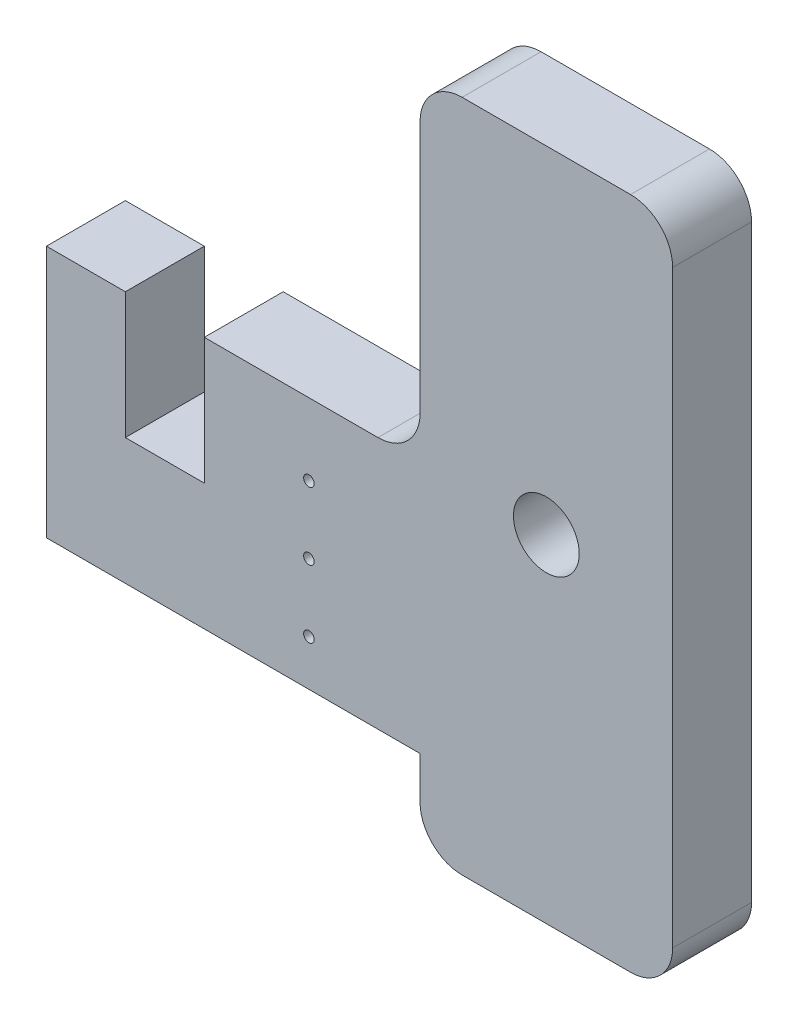
ISO-10303-21;
HEADER;
FILE_DESCRIPTION(('STEP AP214'),'2;1');
FILE_NAME('part.step','',(''),(''),'','','');
FILE_SCHEMA(('AUTOMOTIVE_DESIGN { 1 0 10303 214 1 1 1 1 }'));
ENDSEC;
DATA;
#1=APPLICATION_CONTEXT('core data for automotive mechanical design processes');
#2=APPLICATION_PROTOCOL_DEFINITION('international standard','automotive_design',2000,#1);
#3=PRODUCT_CONTEXT('',#1,'mechanical');
#4=PRODUCT('Part','Part','',(#3));
#5=PRODUCT_RELATED_PRODUCT_CATEGORY('part','',(#4));
#6=PRODUCT_DEFINITION_FORMATION('','',#4);
#7=PRODUCT_DEFINITION_CONTEXT('part definition',#1,'design');
#8=PRODUCT_DEFINITION('design','',#6,#7);
#9=PRODUCT_DEFINITION_SHAPE('','',#8);
#10=(LENGTH_UNIT() NAMED_UNIT(*) SI_UNIT(.MILLI.,.METRE.));
#11=(NAMED_UNIT(*) PLANE_ANGLE_UNIT() SI_UNIT($,.RADIAN.));
#12=(NAMED_UNIT(*) SI_UNIT($,.STERADIAN.) SOLID_ANGLE_UNIT());
#13=UNCERTAINTY_MEASURE_WITH_UNIT(LENGTH_MEASURE(1.E-05),#10,'distance_accuracy_value','');
#14=(GEOMETRIC_REPRESENTATION_CONTEXT(3) GLOBAL_UNCERTAINTY_ASSIGNED_CONTEXT((#13)) GLOBAL_UNIT_ASSIGNED_CONTEXT((#10,
#11,#12)) REPRESENTATION_CONTEXT('',''));
#15=CARTESIAN_POINT('',(0.,0.,0.));
#16=DIRECTION('',(0.,0.,1.));
#17=DIRECTION('',(1.,0.,0.));
#18=AXIS2_PLACEMENT_3D('',#15,#16,#17);
#19=CARTESIAN_POINT('',(0.,0.,9.525));
#20=DIRECTION('',(0.,1.,0.));
#21=DIRECTION('',(-1.,0.,0.));
#22=AXIS2_PLACEMENT_3D('',#19,#20,#21);
#23=PLANE('',#22);
#24=DIRECTION('',(1.,0.,0.));
#25=VECTOR('',#24,1.);
#26=CARTESIAN_POINT('',(0.,0.,9.525));
#27=LINE('',#26,#25);
#28=CARTESIAN_POINT('',(-41.275,0.,9.525));
#29=VERTEX_POINT('',#28);
#30=CARTESIAN_POINT('',(-20.32,0.,9.525));
#31=VERTEX_POINT('',#30);
#32=EDGE_CURVE('E164',#29,#31,#27,.T.);
#33=ORIENTED_EDGE('',*,*,#32,.T.);
#34=DIRECTION('',(0.,0.,-1.));
#35=VECTOR('',#34,1.);
#36=CARTESIAN_POINT('',(-20.32,0.,9.525));
#37=LINE('',#36,#35);
#38=CARTESIAN_POINT('',(-20.32,0.,0.));
#39=VERTEX_POINT('',#38);
#40=EDGE_CURVE('E172',#31,#39,#37,.T.);
#41=ORIENTED_EDGE('',*,*,#40,.T.);
#42=DIRECTION('',(1.,0.,0.));
#43=VECTOR('',#42,1.);
#44=CARTESIAN_POINT('',(0.,0.,0.));
#45=LINE('',#44,#43);
#46=CARTESIAN_POINT('',(-41.275,0.,0.));
#47=VERTEX_POINT('',#46);
#48=EDGE_CURVE('E167',#47,#39,#45,.T.);
#49=ORIENTED_EDGE('',*,*,#48,.F.);
#50=DIRECTION('',(0.,0.,-1.));
#51=VECTOR('',#50,1.);
#52=CARTESIAN_POINT('',(-41.275,0.,9.525));
#53=LINE('',#52,#51);
#54=EDGE_CURVE('E161',#29,#47,#53,.T.);
#55=ORIENTED_EDGE('',*,*,#54,.F.);
#56=EDGE_LOOP('',(#33,#41,#49,#55));
#57=FACE_BOUND('',#56,.T.);
#58=ADVANCED_FACE('F41',(#57),#23,.T.);
#59=CARTESIAN_POINT('',(-41.275,0.,9.525));
#60=DIRECTION('',(-1.,0.,0.));
#61=DIRECTION('',(0.,0.,1.));
#62=AXIS2_PLACEMENT_3D('',#59,#60,#61);
#63=PLANE('',#62);
#64=DIRECTION('',(0.,1.,0.));
#65=VECTOR('',#64,1.);
#66=CARTESIAN_POINT('',(-41.275,0.,0.));
#67=LINE('',#66,#65);
#68=CARTESIAN_POINT('',(-41.275,-15.24,0.));
#69=VERTEX_POINT('',#68);
#70=EDGE_CURVE('E219',#69,#47,#67,.T.);
#71=ORIENTED_EDGE('',*,*,#70,.F.);
#72=DIRECTION('',(0.,0.,-1.));
#73=VECTOR('',#72,1.);
#74=CARTESIAN_POINT('',(-41.275,-15.24,9.525));
#75=LINE('',#74,#73);
#76=CARTESIAN_POINT('',(-41.275,-15.24,9.525));
#77=VERTEX_POINT('',#76);
#78=EDGE_CURVE('E173',#77,#69,#75,.T.);
#79=ORIENTED_EDGE('',*,*,#78,.F.);
#80=DIRECTION('',(0.,1.,0.));
#81=VECTOR('',#80,1.);
#82=CARTESIAN_POINT('',(-41.275,0.,9.525));
#83=LINE('',#82,#81);
#84=EDGE_CURVE('E179',#77,#29,#83,.T.);
#85=ORIENTED_EDGE('',*,*,#84,.T.);
#86=ORIENTED_EDGE('',*,*,#54,.T.);
#87=EDGE_LOOP('',(#71,#79,#85,#86));
#88=FACE_BOUND('',#87,.T.);
#89=ADVANCED_FACE('F185',(#88),#63,.T.);
#90=CARTESIAN_POINT('',(0.,-15.24,9.525));
#91=DIRECTION('',(0.,1.,0.));
#92=DIRECTION('',(-1.,0.,0.));
#93=AXIS2_PLACEMENT_3D('',#90,#91,#92);
#94=PLANE('',#93);
#95=DIRECTION('',(1.,0.,0.));
#96=VECTOR('',#95,1.);
#97=CARTESIAN_POINT('',(0.,-15.24,0.));
#98=LINE('',#97,#96);
#99=CARTESIAN_POINT('',(-50.8,-15.24,0.));
#100=VERTEX_POINT('',#99);
#101=EDGE_CURVE('E221',#100,#69,#98,.T.);
#102=ORIENTED_EDGE('',*,*,#101,.F.);
#103=DIRECTION('',(0.,0.,-1.));
#104=VECTOR('',#103,1.);
#105=CARTESIAN_POINT('',(-50.8,-15.24,9.525));
#106=LINE('',#105,#104);
#107=CARTESIAN_POINT('',(-50.8,-15.24,9.525));
#108=VERTEX_POINT('',#107);
#109=EDGE_CURVE('E259',#108,#100,#106,.T.);
#110=ORIENTED_EDGE('',*,*,#109,.F.);
#111=DIRECTION('',(1.,0.,0.));
#112=VECTOR('',#111,1.);
#113=CARTESIAN_POINT('',(0.,-15.24,9.525));
#114=LINE('',#113,#112);
#115=EDGE_CURVE('E186',#108,#77,#114,.T.);
#116=ORIENTED_EDGE('',*,*,#115,.T.);
#117=ORIENTED_EDGE('',*,*,#78,.T.);
#118=EDGE_LOOP('',(#102,#110,#116,#117));
#119=FACE_BOUND('',#118,.T.);
#120=ADVANCED_FACE('F328',(#119),#94,.T.);
#121=CARTESIAN_POINT('',(-50.8,0.,9.525));
#122=DIRECTION('',(-1.,0.,0.));
#123=DIRECTION('',(0.,0.,1.));
#124=AXIS2_PLACEMENT_3D('',#121,#122,#123);
#125=PLANE('',#124);
#126=DIRECTION('',(0.,1.,0.));
#127=VECTOR('',#126,1.);
#128=CARTESIAN_POINT('',(-50.8,0.,0.));
#129=LINE('',#128,#127);
#130=CARTESIAN_POINT('',(-50.8,0.,0.));
#131=VERTEX_POINT('',#130);
#132=EDGE_CURVE('E224',#100,#131,#129,.T.);
#133=ORIENTED_EDGE('',*,*,#132,.T.);
#134=DIRECTION('',(0.,0.,-1.));
#135=VECTOR('',#134,1.);
#136=CARTESIAN_POINT('',(-50.8,0.,9.525));
#137=LINE('',#136,#135);
#138=CARTESIAN_POINT('',(-50.8,0.,9.525));
#139=VERTEX_POINT('',#138);
#140=EDGE_CURVE('E257',#139,#131,#137,.T.);
#141=ORIENTED_EDGE('',*,*,#140,.F.);
#142=DIRECTION('',(0.,1.,0.));
#143=VECTOR('',#142,1.);
#144=CARTESIAN_POINT('',(-50.8,0.,9.525));
#145=LINE('',#144,#143);
#146=EDGE_CURVE('E188',#108,#139,#145,.T.);
#147=ORIENTED_EDGE('',*,*,#146,.F.);
#148=ORIENTED_EDGE('',*,*,#109,.T.);
#149=EDGE_LOOP('',(#133,#141,#147,#148));
#150=FACE_BOUND('',#149,.T.);
#151=ADVANCED_FACE('F416',(#150),#125,.F.);
#152=CARTESIAN_POINT('',(0.,0.,9.525));
#153=DIRECTION('',(0.,1.,0.));
#154=DIRECTION('',(-1.,0.,0.));
#155=AXIS2_PLACEMENT_3D('',#152,#153,#154);
#156=PLANE('',#155);
#157=DIRECTION('',(1.,0.,0.));
#158=VECTOR('',#157,1.);
#159=CARTESIAN_POINT('',(0.,0.,0.));
#160=LINE('',#159,#158);
#161=CARTESIAN_POINT('',(-60.325,0.,0.));
#162=VERTEX_POINT('',#161);
#163=EDGE_CURVE('E227',#162,#131,#160,.T.);
#164=ORIENTED_EDGE('',*,*,#163,.F.);
#165=DIRECTION('',(0.,0.,-1.));
#166=VECTOR('',#165,1.);
#167=CARTESIAN_POINT('',(-60.325,0.,9.525));
#168=LINE('',#167,#166);
#169=CARTESIAN_POINT('',(-60.325,0.,9.525));
#170=VERTEX_POINT('',#169);
#171=EDGE_CURVE('E255',#170,#162,#168,.T.);
#172=ORIENTED_EDGE('',*,*,#171,.F.);
#173=DIRECTION('',(1.,0.,0.));
#174=VECTOR('',#173,1.);
#175=CARTESIAN_POINT('',(0.,0.,9.525));
#176=LINE('',#175,#174);
#177=EDGE_CURVE('E193',#170,#139,#176,.T.);
#178=ORIENTED_EDGE('',*,*,#177,.T.);
#179=ORIENTED_EDGE('',*,*,#140,.T.);
#180=EDGE_LOOP('',(#164,#172,#178,#179));
#181=FACE_BOUND('',#180,.T.);
#182=ADVANCED_FACE('F412',(#181),#156,.T.);
#183=CARTESIAN_POINT('',(-60.325,0.,9.525));
#184=DIRECTION('',(1.,0.,0.));
#185=DIRECTION('',(0.,1.,0.));
#186=AXIS2_PLACEMENT_3D('',#183,#184,#185);
#187=PLANE('',#186);
#188=DIRECTION('',(0.,-1.,0.));
#189=VECTOR('',#188,1.);
#190=CARTESIAN_POINT('',(-60.325,0.,0.));
#191=LINE('',#190,#189);
#192=CARTESIAN_POINT('',(-60.325,-30.48,0.));
#193=VERTEX_POINT('',#192);
#194=EDGE_CURVE('E230',#162,#193,#191,.T.);
#195=ORIENTED_EDGE('',*,*,#194,.T.);
#196=DIRECTION('',(0.,0.,-1.));
#197=VECTOR('',#196,1.);
#198=CARTESIAN_POINT('',(-60.325,-30.48,9.525));
#199=LINE('',#198,#197);
#200=CARTESIAN_POINT('',(-60.325,-30.48,9.525));
#201=VERTEX_POINT('',#200);
#202=EDGE_CURVE('E252',#201,#193,#199,.T.);
#203=ORIENTED_EDGE('',*,*,#202,.F.);
#204=DIRECTION('',(0.,-1.,0.));
#205=VECTOR('',#204,1.);
#206=CARTESIAN_POINT('',(-60.325,0.,9.525));
#207=LINE('',#206,#205);
#208=EDGE_CURVE('E196',#170,#201,#207,.T.);
#209=ORIENTED_EDGE('',*,*,#208,.F.);
#210=ORIENTED_EDGE('',*,*,#171,.T.);
#211=EDGE_LOOP('',(#195,#203,#209,#210));
#212=FACE_BOUND('',#211,.T.);
#213=ADVANCED_FACE('F408',(#212),#187,.F.);
#214=CARTESIAN_POINT('',(0.,-30.48,9.525));
#215=DIRECTION('',(0.,1.,0.));
#216=DIRECTION('',(-1.,0.,0.));
#217=AXIS2_PLACEMENT_3D('',#214,#215,#216);
#218=PLANE('',#217);
#219=DIRECTION('',(1.,0.,0.));
#220=VECTOR('',#219,1.);
#221=CARTESIAN_POINT('',(0.,-30.48,0.));
#222=LINE('',#221,#220);
#223=CARTESIAN_POINT('',(-15.24,-30.48,0.));
#224=VERTEX_POINT('',#223);
#225=EDGE_CURVE('E233',#193,#224,#222,.T.);
#226=ORIENTED_EDGE('',*,*,#225,.T.);
#227=DIRECTION('',(0.,0.,-1.));
#228=VECTOR('',#227,1.);
#229=CARTESIAN_POINT('',(-15.24,-30.48,9.525));
#230=LINE('',#229,#228);
#231=CARTESIAN_POINT('',(-15.24,-30.48,9.525));
#232=VERTEX_POINT('',#231);
#233=EDGE_CURVE('E213',#232,#224,#230,.T.);
#234=ORIENTED_EDGE('',*,*,#233,.F.);
#235=DIRECTION('',(1.,0.,0.));
#236=VECTOR('',#235,1.);
#237=CARTESIAN_POINT('',(0.,-30.48,9.525));
#238=LINE('',#237,#236);
#239=EDGE_CURVE('E199',#201,#232,#238,.T.);
#240=ORIENTED_EDGE('',*,*,#239,.F.);
#241=ORIENTED_EDGE('',*,*,#202,.T.);
#242=EDGE_LOOP('',(#226,#234,#240,#241));
#243=FACE_BOUND('',#242,.T.);
#244=ADVANCED_FACE('F404',(#243),#218,.F.);
#245=CARTESIAN_POINT('',(-15.24,0.,9.525));
#246=DIRECTION('',(-1.,0.,0.));
#247=DIRECTION('',(0.,0.,1.));
#248=AXIS2_PLACEMENT_3D('',#245,#246,#247);
#249=PLANE('',#248);
#250=DIRECTION('',(0.,1.,0.));
#251=VECTOR('',#250,1.);
#252=CARTESIAN_POINT('',(-15.24,0.,0.));
#253=LINE('',#252,#251);
#254=CARTESIAN_POINT('',(-15.24,-35.56,0.));
#255=VERTEX_POINT('',#254);
#256=EDGE_CURVE('E236',#255,#224,#253,.T.);
#257=ORIENTED_EDGE('',*,*,#256,.F.);
#258=DIRECTION('',(0.,0.,-1.));
#259=VECTOR('',#258,1.);
#260=CARTESIAN_POINT('',(-15.24,-35.56,9.525));
#261=LINE('',#260,#259);
#262=CARTESIAN_POINT('',(-15.24,-35.56,9.525));
#263=VERTEX_POINT('',#262);
#264=EDGE_CURVE('E281',#255,#263,#261,.F.);
#265=ORIENTED_EDGE('',*,*,#264,.T.);
#266=DIRECTION('',(0.,1.,0.));
#267=VECTOR('',#266,1.);
#268=CARTESIAN_POINT('',(-15.24,0.,9.525));
#269=LINE('',#268,#267);
#270=EDGE_CURVE('E202',#263,#232,#269,.T.);
#271=ORIENTED_EDGE('',*,*,#270,.T.);
#272=ORIENTED_EDGE('',*,*,#233,.T.);
#273=EDGE_LOOP('',(#257,#265,#271,#272));
#274=FACE_BOUND('',#273,.T.);
#275=ADVANCED_FACE('F400',(#274),#249,.T.);
#276=CARTESIAN_POINT('',(0.,-40.64,9.525));
#277=DIRECTION('',(0.,1.,0.));
#278=DIRECTION('',(0.,0.,1.));
#279=AXIS2_PLACEMENT_3D('',#276,#277,#278);
#280=PLANE('',#279);
#281=DIRECTION('',(1.,0.,0.));
#282=VECTOR('',#281,1.);
#283=CARTESIAN_POINT('',(0.,-40.64,9.525));
#284=LINE('',#283,#282);
#285=CARTESIAN_POINT('',(-10.16,-40.64,9.525));
#286=VERTEX_POINT('',#285);
#287=CARTESIAN_POINT('',(10.16,-40.64,9.525));
#288=VERTEX_POINT('',#287);
#289=EDGE_CURVE('E204',#286,#288,#284,.T.);
#290=ORIENTED_EDGE('',*,*,#289,.F.);
#291=DIRECTION('',(0.,0.,-1.));
#292=VECTOR('',#291,1.);
#293=CARTESIAN_POINT('',(-10.16,-40.64,0.));
#294=LINE('',#293,#292);
#295=CARTESIAN_POINT('',(-10.16,-40.64,0.));
#296=VERTEX_POINT('',#295);
#297=EDGE_CURVE('E270',#286,#296,#294,.T.);
#298=ORIENTED_EDGE('',*,*,#297,.T.);
#299=DIRECTION('',(1.,0.,0.));
#300=VECTOR('',#299,1.);
#301=CARTESIAN_POINT('',(0.,-40.64,0.));
#302=LINE('',#301,#300);
#303=CARTESIAN_POINT('',(10.16,-40.64,0.));
#304=VERTEX_POINT('',#303);
#305=EDGE_CURVE('E238',#296,#304,#302,.T.);
#306=ORIENTED_EDGE('',*,*,#305,.T.);
#307=DIRECTION('',(0.,0.,-1.));
#308=VECTOR('',#307,1.);
#309=CARTESIAN_POINT('',(10.16,-40.64,9.525));
#310=LINE('',#309,#308);
#311=EDGE_CURVE('E268',#304,#288,#310,.F.);
#312=ORIENTED_EDGE('',*,*,#311,.T.);
#313=EDGE_LOOP('',(#290,#298,#306,#312));
#314=FACE_BOUND('',#313,.T.);
#315=ADVANCED_FACE('F396',(#314),#280,.F.);
#316=CARTESIAN_POINT('',(15.24,0.,9.525));
#317=DIRECTION('',(-1.,0.,0.));
#318=DIRECTION('',(0.,0.,1.));
#319=AXIS2_PLACEMENT_3D('',#316,#317,#318);
#320=PLANE('',#319);
#321=DIRECTION('',(0.,1.,0.));
#322=VECTOR('',#321,1.);
#323=CARTESIAN_POINT('',(15.24,0.,0.));
#324=LINE('',#323,#322);
#325=CARTESIAN_POINT('',(15.24,-35.56,0.));
#326=VERTEX_POINT('',#325);
#327=CARTESIAN_POINT('',(15.24,35.56,0.));
#328=VERTEX_POINT('',#327);
#329=EDGE_CURVE('E241',#326,#328,#324,.T.);
#330=ORIENTED_EDGE('',*,*,#329,.T.);
#331=DIRECTION('',(0.,0.,-1.));
#332=VECTOR('',#331,1.);
#333=CARTESIAN_POINT('',(15.24,35.56,9.525));
#334=LINE('',#333,#332);
#335=CARTESIAN_POINT('',(15.24,35.56,9.525));
#336=VERTEX_POINT('',#335);
#337=EDGE_CURVE('E297',#328,#336,#334,.F.);
#338=ORIENTED_EDGE('',*,*,#337,.T.);
#339=DIRECTION('',(0.,1.,0.));
#340=VECTOR('',#339,1.);
#341=CARTESIAN_POINT('',(15.24,0.,9.525));
#342=LINE('',#341,#340);
#343=CARTESIAN_POINT('',(15.24,-35.56,9.525));
#344=VERTEX_POINT('',#343);
#345=EDGE_CURVE('E207',#344,#336,#342,.T.);
#346=ORIENTED_EDGE('',*,*,#345,.F.);
#347=DIRECTION('',(0.,0.,-1.));
#348=VECTOR('',#347,1.);
#349=CARTESIAN_POINT('',(15.24,-35.56,9.525));
#350=LINE('',#349,#348);
#351=EDGE_CURVE('E294',#344,#326,#350,.T.);
#352=ORIENTED_EDGE('',*,*,#351,.T.);
#353=EDGE_LOOP('',(#330,#338,#346,#352));
#354=FACE_BOUND('',#353,.T.);
#355=ADVANCED_FACE('F340',(#354),#320,.F.);
#356=CARTESIAN_POINT('',(0.,40.64,9.525));
#357=DIRECTION('',(0.,1.,0.));
#358=DIRECTION('',(0.,0.,1.));
#359=AXIS2_PLACEMENT_3D('',#356,#357,#358);
#360=PLANE('',#359);
#361=DIRECTION('',(1.,0.,0.));
#362=VECTOR('',#361,1.);
#363=CARTESIAN_POINT('',(0.,40.64,0.));
#364=LINE('',#363,#362);
#365=CARTESIAN_POINT('',(-10.16,40.64,0.));
#366=VERTEX_POINT('',#365);
#367=CARTESIAN_POINT('',(10.16,40.64,0.));
#368=VERTEX_POINT('',#367);
#369=EDGE_CURVE('E244',#366,#368,#364,.T.);
#370=ORIENTED_EDGE('',*,*,#369,.F.);
#371=DIRECTION('',(0.,0.,-1.));
#372=VECTOR('',#371,1.);
#373=CARTESIAN_POINT('',(-10.16,40.64,9.525));
#374=LINE('',#373,#372);
#375=CARTESIAN_POINT('',(-10.16,40.64,9.525));
#376=VERTEX_POINT('',#375);
#377=EDGE_CURVE('E63',#366,#376,#374,.F.);
#378=ORIENTED_EDGE('',*,*,#377,.T.);
#379=DIRECTION('',(1.,0.,0.));
#380=VECTOR('',#379,1.);
#381=CARTESIAN_POINT('',(0.,40.64,9.525));
#382=LINE('',#381,#380);
#383=CARTESIAN_POINT('',(10.16,40.64,9.525));
#384=VERTEX_POINT('',#383);
#385=EDGE_CURVE('E209',#376,#384,#382,.T.);
#386=ORIENTED_EDGE('',*,*,#385,.T.);
#387=DIRECTION('',(0.,0.,-1.));
#388=VECTOR('',#387,1.);
#389=CARTESIAN_POINT('',(10.16,40.64,0.));
#390=LINE('',#389,#388);
#391=EDGE_CURVE('E290',#384,#368,#390,.T.);
#392=ORIENTED_EDGE('',*,*,#391,.T.);
#393=EDGE_LOOP('',(#370,#378,#386,#392));
#394=FACE_BOUND('',#393,.T.);
#395=ADVANCED_FACE('F333',(#394),#360,.T.);
#396=CARTESIAN_POINT('',(0.,0.,9.525));
#397=DIRECTION('',(0.,0.,-1.));
#398=DIRECTION('',(-1.,0.,0.));
#399=AXIS2_PLACEMENT_3D('',#396,#397,#398);
#400=CYLINDRICAL_SURFACE('',#399,3.96875);
#401=CARTESIAN_POINT('',(0.,0.,9.525));
#402=DIRECTION('',(0.,0.,1.));
#403=DIRECTION('',(1.,0.,0.));
#404=AXIS2_PLACEMENT_3D('',#401,#402,#403);
#405=CIRCLE('',#404,3.96875);
#406=CARTESIAN_POINT('',(3.96875,0.,9.525));
#407=VERTEX_POINT('',#406);
#408=EDGE_CURVE('E183',#407,#407,#405,.T.);
#409=ORIENTED_EDGE('',*,*,#408,.T.);
#410=EDGE_LOOP('',(#409));
#411=FACE_BOUND('',#410,.T.);
#412=CARTESIAN_POINT('',(0.,0.,0.));
#413=DIRECTION('',(0.,0.,1.));
#414=DIRECTION('',(1.,0.,0.));
#415=AXIS2_PLACEMENT_3D('',#412,#413,#414);
#416=CIRCLE('',#415,3.96875);
#417=CARTESIAN_POINT('',(3.96875,0.,0.));
#418=VERTEX_POINT('',#417);
#419=EDGE_CURVE('E214',#418,#418,#416,.T.);
#420=ORIENTED_EDGE('',*,*,#419,.F.);
#421=EDGE_LOOP('',(#420));
#422=FACE_BOUND('',#421,.T.);
#423=ADVANCED_FACE('F331',(#411,#422),#400,.F.);
#424=CARTESIAN_POINT('',(-15.24,0.,9.525));
#425=DIRECTION('',(1.,0.,0.));
#426=DIRECTION('',(0.,1.,0.));
#427=AXIS2_PLACEMENT_3D('',#424,#425,#426);
#428=PLANE('',#427);
#429=DIRECTION('',(0.,-1.,0.));
#430=VECTOR('',#429,1.);
#431=CARTESIAN_POINT('',(-15.24,0.,0.));
#432=LINE('',#431,#430);
#433=CARTESIAN_POINT('',(-15.24,35.56,0.));
#434=VERTEX_POINT('',#433);
#435=CARTESIAN_POINT('',(-15.24,5.08000000000002,0.));
#436=VERTEX_POINT('',#435);
#437=EDGE_CURVE('E247',#434,#436,#432,.T.);
#438=ORIENTED_EDGE('',*,*,#437,.T.);
#439=DIRECTION('',(0.,0.,-1.));
#440=VECTOR('',#439,1.);
#441=CARTESIAN_POINT('',(-15.24,5.08000000000002,9.525));
#442=LINE('',#441,#440);
#443=CARTESIAN_POINT('',(-15.24,5.08000000000002,9.525));
#444=VERTEX_POINT('',#443);
#445=EDGE_CURVE('E266',#436,#444,#442,.F.);
#446=ORIENTED_EDGE('',*,*,#445,.T.);
#447=DIRECTION('',(0.,-1.,0.));
#448=VECTOR('',#447,1.);
#449=CARTESIAN_POINT('',(-15.24,0.,9.525));
#450=LINE('',#449,#448);
#451=CARTESIAN_POINT('',(-15.24,35.56,9.525));
#452=VERTEX_POINT('',#451);
#453=EDGE_CURVE('E211',#452,#444,#450,.T.);
#454=ORIENTED_EDGE('',*,*,#453,.F.);
#455=DIRECTION('',(0.,0.,-1.));
#456=VECTOR('',#455,1.);
#457=CARTESIAN_POINT('',(-15.24,35.56,0.));
#458=LINE('',#457,#456);
#459=EDGE_CURVE('E263',#452,#434,#458,.T.);
#460=ORIENTED_EDGE('',*,*,#459,.T.);
#461=EDGE_LOOP('',(#438,#446,#454,#460));
#462=FACE_BOUND('',#461,.T.);
#463=ADVANCED_FACE('F305',(#462),#428,.F.);
#464=CARTESIAN_POINT('',(0.,0.,9.525));
#465=DIRECTION('',(0.,0.,1.));
#466=DIRECTION('',(1.,0.,0.));
#467=AXIS2_PLACEMENT_3D('',#464,#465,#466);
#468=PLANE('',#467);
#469=CARTESIAN_POINT('',(-28.6512000000001,-8.68299999999999,9.525));
#470=DIRECTION('',(0.,0.,1.));
#471=DIRECTION('',(1.,0.,0.));
#472=AXIS2_PLACEMENT_3D('',#469,#470,#471);
#473=CIRCLE('',#472,0.634999999999999);
#474=CARTESIAN_POINT('',(-28.0162000000001,-8.68299999999999,9.525));
#475=VERTEX_POINT('',#474);
#476=EDGE_CURVE('E359',#475,#475,#473,.T.);
#477=ORIENTED_EDGE('',*,*,#476,.F.);
#478=EDGE_LOOP('',(#477));
#479=FACE_BOUND('',#478,.T.);
#480=CARTESIAN_POINT('',(-28.6512000000001,-16.8255456111321,9.525));
#481=DIRECTION('',(0.,0.,1.));
#482=DIRECTION('',(1.,0.,0.));
#483=AXIS2_PLACEMENT_3D('',#480,#481,#482);
#484=CIRCLE('',#483,0.634999999999999);
#485=CARTESIAN_POINT('',(-28.0162000000001,-16.8255456111321,9.525));
#486=VERTEX_POINT('',#485);
#487=EDGE_CURVE('E352',#486,#486,#484,.T.);
#488=ORIENTED_EDGE('',*,*,#487,.F.);
#489=EDGE_LOOP('',(#488));
#490=FACE_BOUND('',#489,.T.);
#491=CARTESIAN_POINT('',(-28.6512000000001,-24.9680912222642,9.525));
#492=DIRECTION('',(0.,0.,1.));
#493=DIRECTION('',(1.,0.,0.));
#494=AXIS2_PLACEMENT_3D('',#491,#492,#493);
#495=CIRCLE('',#494,0.634999999999999);
#496=CARTESIAN_POINT('',(-28.0162000000001,-24.9680912222642,9.525));
#497=VERTEX_POINT('',#496);
#498=EDGE_CURVE('E353',#497,#497,#495,.T.);
#499=ORIENTED_EDGE('',*,*,#498,.F.);
#500=EDGE_LOOP('',(#499));
#501=FACE_BOUND('',#500,.T.);
#502=ORIENTED_EDGE('',*,*,#408,.F.);
#503=EDGE_LOOP('',(#502));
#504=FACE_BOUND('',#503,.T.);
#505=ORIENTED_EDGE('',*,*,#270,.F.);
#506=CARTESIAN_POINT('',(-10.16,-35.56,9.525));
#507=DIRECTION('',(0.,0.,1.));
#508=DIRECTION('',(1.,0.,0.));
#509=AXIS2_PLACEMENT_3D('',#506,#507,#508);
#510=CIRCLE('',#509,5.08);
#511=EDGE_CURVE('E288',#263,#286,#510,.T.);
#512=ORIENTED_EDGE('',*,*,#511,.T.);
#513=ORIENTED_EDGE('',*,*,#289,.T.);
#514=CARTESIAN_POINT('',(10.16,-35.56,9.525));
#515=DIRECTION('',(0.,0.,1.));
#516=DIRECTION('',(1.,0.,0.));
#517=AXIS2_PLACEMENT_3D('',#514,#515,#516);
#518=CIRCLE('',#517,5.08);
#519=EDGE_CURVE('E283',#288,#344,#518,.T.);
#520=ORIENTED_EDGE('',*,*,#519,.T.);
#521=ORIENTED_EDGE('',*,*,#345,.T.);
#522=CARTESIAN_POINT('',(10.16,35.56,9.525));
#523=DIRECTION('',(0.,0.,1.));
#524=DIRECTION('',(1.,0.,0.));
#525=AXIS2_PLACEMENT_3D('',#522,#523,#524);
#526=CIRCLE('',#525,5.08);
#527=EDGE_CURVE('E56',#336,#384,#526,.T.);
#528=ORIENTED_EDGE('',*,*,#527,.T.);
#529=ORIENTED_EDGE('',*,*,#385,.F.);
#530=CARTESIAN_POINT('',(-10.16,35.56,9.525));
#531=DIRECTION('',(0.,0.,1.));
#532=DIRECTION('',(1.,0.,0.));
#533=AXIS2_PLACEMENT_3D('',#530,#531,#532);
#534=CIRCLE('',#533,5.08);
#535=EDGE_CURVE('E286',#376,#452,#534,.T.);
#536=ORIENTED_EDGE('',*,*,#535,.T.);
#537=ORIENTED_EDGE('',*,*,#453,.T.);
#538=CARTESIAN_POINT('',(-20.32,5.08000000000002,9.525));
#539=DIRECTION('',(0.,0.,1.));
#540=DIRECTION('',(1.,0.,0.));
#541=AXIS2_PLACEMENT_3D('',#538,#539,#540);
#542=CIRCLE('',#541,5.08);
#543=EDGE_CURVE('E11',#444,#31,#542,.F.);
#544=ORIENTED_EDGE('',*,*,#543,.T.);
#545=ORIENTED_EDGE('',*,*,#32,.F.);
#546=ORIENTED_EDGE('',*,*,#84,.F.);
#547=ORIENTED_EDGE('',*,*,#115,.F.);
#548=ORIENTED_EDGE('',*,*,#146,.T.);
#549=ORIENTED_EDGE('',*,*,#177,.F.);
#550=ORIENTED_EDGE('',*,*,#208,.T.);
#551=ORIENTED_EDGE('',*,*,#239,.T.);
#552=EDGE_LOOP('',(#505,#512,#513,#520,#521,#528,#529,#536,#537,#544,#545,#546,#547,#548,#549,
#550,#551));
#553=FACE_BOUND('',#552,.T.);
#554=ADVANCED_FACE('F177',(#479,#490,#501,#504,#553),#468,.T.);
#555=CARTESIAN_POINT('',(0.,0.,0.));
#556=DIRECTION('',(0.,0.,1.));
#557=DIRECTION('',(1.,0.,0.));
#558=AXIS2_PLACEMENT_3D('',#555,#556,#557);
#559=PLANE('',#558);
#560=CARTESIAN_POINT('',(-28.6512000000001,-8.68299999999999,0.));
#561=DIRECTION('',(0.,0.,1.));
#562=DIRECTION('',(1.,0.,0.));
#563=AXIS2_PLACEMENT_3D('',#560,#561,#562);
#564=CIRCLE('',#563,0.634999999999999);
#565=CARTESIAN_POINT('',(-28.0162000000001,-8.68299999999999,0.));
#566=VERTEX_POINT('',#565);
#567=EDGE_CURVE('E217',#566,#566,#564,.F.);
#568=ORIENTED_EDGE('',*,*,#567,.F.);
#569=EDGE_LOOP('',(#568));
#570=FACE_BOUND('',#569,.T.);
#571=CARTESIAN_POINT('',(-28.6512000000001,-16.8255456111321,0.));
#572=DIRECTION('',(0.,0.,1.));
#573=DIRECTION('',(1.,0.,0.));
#574=AXIS2_PLACEMENT_3D('',#571,#572,#573);
#575=CIRCLE('',#574,0.634999999999999);
#576=CARTESIAN_POINT('',(-28.0162000000001,-16.8255456111321,0.));
#577=VERTEX_POINT('',#576);
#578=EDGE_CURVE('E356',#577,#577,#575,.F.);
#579=ORIENTED_EDGE('',*,*,#578,.F.);
#580=EDGE_LOOP('',(#579));
#581=FACE_BOUND('',#580,.T.);
#582=CARTESIAN_POINT('',(-28.6512000000001,-24.9680912222642,0.));
#583=DIRECTION('',(0.,0.,1.));
#584=DIRECTION('',(1.,0.,0.));
#585=AXIS2_PLACEMENT_3D('',#582,#583,#584);
#586=CIRCLE('',#585,0.634999999999999);
#587=CARTESIAN_POINT('',(-28.0162000000001,-24.9680912222642,0.));
#588=VERTEX_POINT('',#587);
#589=EDGE_CURVE('E349',#588,#588,#586,.F.);
#590=ORIENTED_EDGE('',*,*,#589,.F.);
#591=EDGE_LOOP('',(#590));
#592=FACE_BOUND('',#591,.T.);
#593=ORIENTED_EDGE('',*,*,#419,.T.);
#594=EDGE_LOOP('',(#593));
#595=FACE_BOUND('',#594,.T.);
#596=ORIENTED_EDGE('',*,*,#305,.F.);
#597=CARTESIAN_POINT('',(-10.16,-35.56,0.));
#598=DIRECTION('',(0.,0.,1.));
#599=DIRECTION('',(1.,0.,0.));
#600=AXIS2_PLACEMENT_3D('',#597,#598,#599);
#601=CIRCLE('',#600,5.08);
#602=EDGE_CURVE('E279',#296,#255,#601,.F.);
#603=ORIENTED_EDGE('',*,*,#602,.T.);
#604=ORIENTED_EDGE('',*,*,#256,.T.);
#605=ORIENTED_EDGE('',*,*,#225,.F.);
#606=ORIENTED_EDGE('',*,*,#194,.F.);
#607=ORIENTED_EDGE('',*,*,#163,.T.);
#608=ORIENTED_EDGE('',*,*,#132,.F.);
#609=ORIENTED_EDGE('',*,*,#101,.T.);
#610=ORIENTED_EDGE('',*,*,#70,.T.);
#611=ORIENTED_EDGE('',*,*,#48,.T.);
#612=CARTESIAN_POINT('',(-20.32,5.08000000000002,0.));
#613=DIRECTION('',(0.,0.,1.));
#614=DIRECTION('',(1.,0.,0.));
#615=AXIS2_PLACEMENT_3D('',#612,#613,#614);
#616=CIRCLE('',#615,5.08);
#617=EDGE_CURVE('E49',#39,#436,#616,.T.);
#618=ORIENTED_EDGE('',*,*,#617,.T.);
#619=ORIENTED_EDGE('',*,*,#437,.F.);
#620=CARTESIAN_POINT('',(-10.16,35.56,0.));
#621=DIRECTION('',(0.,0.,1.));
#622=DIRECTION('',(1.,0.,0.));
#623=AXIS2_PLACEMENT_3D('',#620,#621,#622);
#624=CIRCLE('',#623,5.08);
#625=EDGE_CURVE('E277',#434,#366,#624,.F.);
#626=ORIENTED_EDGE('',*,*,#625,.T.);
#627=ORIENTED_EDGE('',*,*,#369,.T.);
#628=CARTESIAN_POINT('',(10.16,35.56,0.));
#629=DIRECTION('',(0.,0.,1.));
#630=DIRECTION('',(1.,0.,0.));
#631=AXIS2_PLACEMENT_3D('',#628,#629,#630);
#632=CIRCLE('',#631,5.08);
#633=EDGE_CURVE('E275',#368,#328,#632,.F.);
#634=ORIENTED_EDGE('',*,*,#633,.T.);
#635=ORIENTED_EDGE('',*,*,#329,.F.);
#636=CARTESIAN_POINT('',(10.16,-35.56,0.));
#637=DIRECTION('',(0.,0.,1.));
#638=DIRECTION('',(1.,0.,0.));
#639=AXIS2_PLACEMENT_3D('',#636,#637,#638);
#640=CIRCLE('',#639,5.08);
#641=EDGE_CURVE('E273',#326,#304,#640,.F.);
#642=ORIENTED_EDGE('',*,*,#641,.T.);
#643=EDGE_LOOP('',(#596,#603,#604,#605,#606,#607,#608,#609,#610,#611,#618,#619,#626,#627,#634,
#635,#642));
#644=FACE_BOUND('',#643,.T.);
#645=ADVANCED_FACE('F301',(#570,#581,#592,#595,#644),#559,.F.);
#646=CARTESIAN_POINT('',(-20.32,5.08000000000002,9.525));
#647=DIRECTION('',(0.,0.,-1.));
#648=DIRECTION('',(-1.,0.,0.));
#649=AXIS2_PLACEMENT_3D('',#646,#647,#648);
#650=CYLINDRICAL_SURFACE('',#649,5.08);
#651=ORIENTED_EDGE('',*,*,#543,.F.);
#652=ORIENTED_EDGE('',*,*,#445,.F.);
#653=ORIENTED_EDGE('',*,*,#617,.F.);
#654=ORIENTED_EDGE('',*,*,#40,.F.);
#655=EDGE_LOOP('',(#651,#652,#653,#654));
#656=FACE_BOUND('',#655,.T.);
#657=ADVANCED_FACE('F308',(#656),#650,.F.);
#658=CARTESIAN_POINT('',(-10.16,-35.56,9.525));
#659=DIRECTION('',(0.,0.,1.));
#660=DIRECTION('',(1.,0.,0.));
#661=AXIS2_PLACEMENT_3D('',#658,#659,#660);
#662=CYLINDRICAL_SURFACE('',#661,5.08);
#663=ORIENTED_EDGE('',*,*,#511,.F.);
#664=ORIENTED_EDGE('',*,*,#264,.F.);
#665=ORIENTED_EDGE('',*,*,#602,.F.);
#666=ORIENTED_EDGE('',*,*,#297,.F.);
#667=EDGE_LOOP('',(#663,#664,#665,#666));
#668=FACE_BOUND('',#667,.T.);
#669=ADVANCED_FACE('F310',(#668),#662,.T.);
#670=CARTESIAN_POINT('',(-10.16,35.56,9.525));
#671=DIRECTION('',(0.,0.,1.));
#672=DIRECTION('',(1.,0.,0.));
#673=AXIS2_PLACEMENT_3D('',#670,#671,#672);
#674=CYLINDRICAL_SURFACE('',#673,5.08);
#675=ORIENTED_EDGE('',*,*,#535,.F.);
#676=ORIENTED_EDGE('',*,*,#377,.F.);
#677=ORIENTED_EDGE('',*,*,#625,.F.);
#678=ORIENTED_EDGE('',*,*,#459,.F.);
#679=EDGE_LOOP('',(#675,#676,#677,#678));
#680=FACE_BOUND('',#679,.T.);
#681=ADVANCED_FACE('F316',(#680),#674,.T.);
#682=CARTESIAN_POINT('',(10.16,35.56,9.525));
#683=DIRECTION('',(0.,0.,1.));
#684=DIRECTION('',(1.,0.,0.));
#685=AXIS2_PLACEMENT_3D('',#682,#683,#684);
#686=CYLINDRICAL_SURFACE('',#685,5.08);
#687=ORIENTED_EDGE('',*,*,#527,.F.);
#688=ORIENTED_EDGE('',*,*,#337,.F.);
#689=ORIENTED_EDGE('',*,*,#633,.F.);
#690=ORIENTED_EDGE('',*,*,#391,.F.);
#691=EDGE_LOOP('',(#687,#688,#689,#690));
#692=FACE_BOUND('',#691,.T.);
#693=ADVANCED_FACE('F390',(#692),#686,.T.);
#694=CARTESIAN_POINT('',(10.16,-35.56,9.525));
#695=DIRECTION('',(0.,0.,-1.));
#696=DIRECTION('',(-1.,0.,0.));
#697=AXIS2_PLACEMENT_3D('',#694,#695,#696);
#698=CYLINDRICAL_SURFACE('',#697,5.08);
#699=ORIENTED_EDGE('',*,*,#519,.F.);
#700=ORIENTED_EDGE('',*,*,#311,.F.);
#701=ORIENTED_EDGE('',*,*,#641,.F.);
#702=ORIENTED_EDGE('',*,*,#351,.F.);
#703=EDGE_LOOP('',(#699,#700,#701,#702));
#704=FACE_BOUND('',#703,.T.);
#705=ADVANCED_FACE('F43',(#704),#698,.T.);
#706=CARTESIAN_POINT('',(-28.6512000000001,-24.9680912222642,-0.000999999999999265));
#707=DIRECTION('',(0.,0.,1.));
#708=DIRECTION('',(1.,0.,0.));
#709=AXIS2_PLACEMENT_3D('',#706,#707,#708);
#710=CYLINDRICAL_SURFACE('',#709,0.634999999999999);
#711=ORIENTED_EDGE('',*,*,#498,.T.);
#712=EDGE_LOOP('',(#711));
#713=FACE_BOUND('',#712,.T.);
#714=ORIENTED_EDGE('',*,*,#589,.T.);
#715=EDGE_LOOP('',(#714));
#716=FACE_BOUND('',#715,.T.);
#717=ADVANCED_FACE('F377',(#713,#716),#710,.F.);
#718=CARTESIAN_POINT('',(-28.6512000000001,-16.8255456111321,-0.000999999999999265));
#719=DIRECTION('',(0.,0.,1.));
#720=DIRECTION('',(1.,0.,0.));
#721=AXIS2_PLACEMENT_3D('',#718,#719,#720);
#722=CYLINDRICAL_SURFACE('',#721,0.634999999999999);
#723=ORIENTED_EDGE('',*,*,#487,.T.);
#724=EDGE_LOOP('',(#723));
#725=FACE_BOUND('',#724,.T.);
#726=ORIENTED_EDGE('',*,*,#578,.T.);
#727=EDGE_LOOP('',(#726));
#728=FACE_BOUND('',#727,.T.);
#729=ADVANCED_FACE('F380',(#725,#728),#722,.F.);
#730=CARTESIAN_POINT('',(-28.6512000000001,-8.68299999999999,-0.000999999999999265));
#731=DIRECTION('',(0.,0.,1.));
#732=DIRECTION('',(1.,0.,0.));
#733=AXIS2_PLACEMENT_3D('',#730,#731,#732);
#734=CYLINDRICAL_SURFACE('',#733,0.634999999999999);
#735=ORIENTED_EDGE('',*,*,#476,.T.);
#736=EDGE_LOOP('',(#735));
#737=FACE_BOUND('',#736,.T.);
#738=ORIENTED_EDGE('',*,*,#567,.T.);
#739=EDGE_LOOP('',(#738));
#740=FACE_BOUND('',#739,.T.);
#741=ADVANCED_FACE('F367',(#737,#740),#734,.F.);
#742=CLOSED_SHELL('',(#58,#89,#120,#151,#182,#213,#244,#275,#315,#355,#395,#423,#463,#554,#645,
#657,#669,#681,#693,#705,#717,#729,#741));
#743=MANIFOLD_SOLID_BREP('B2',#742);
#744=ADVANCED_BREP_SHAPE_REPRESENTATION('',(#18,#743),#14);
#745=SHAPE_DEFINITION_REPRESENTATION(#9,#744);
ENDSEC;
END-ISO-10303-21;
